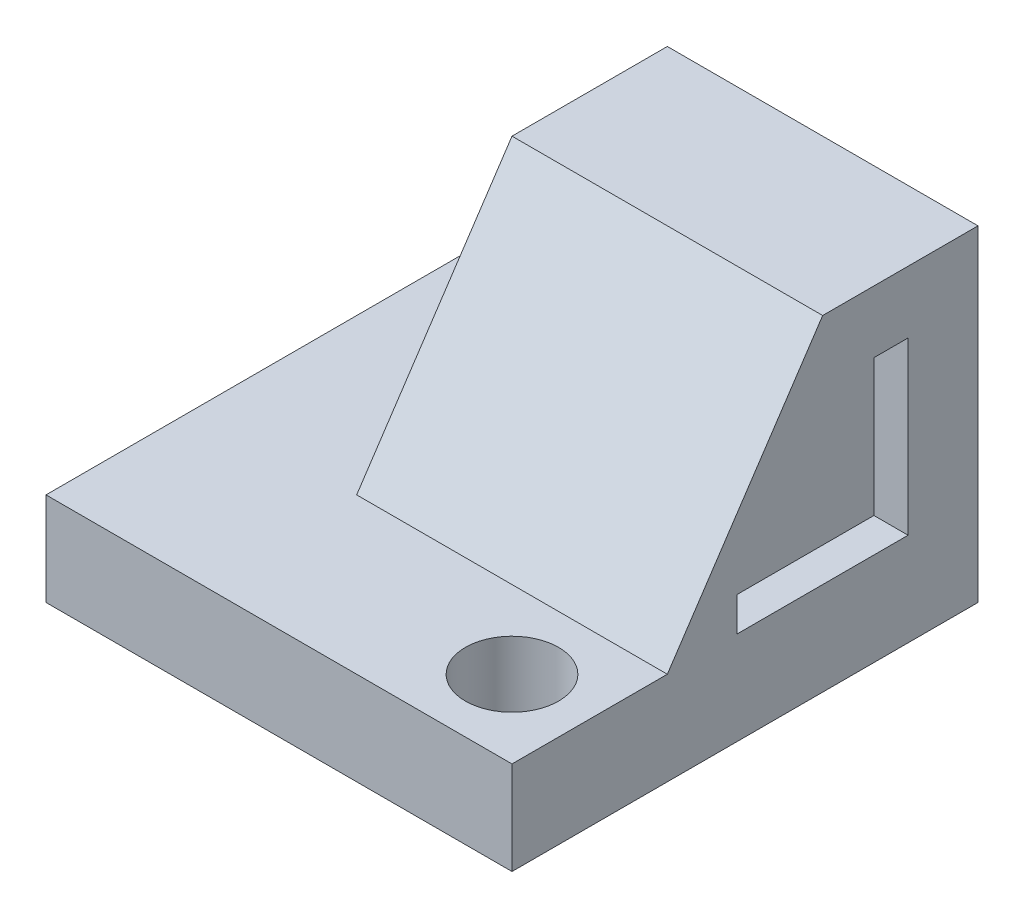
ISO-10303-21;
HEADER;
FILE_DESCRIPTION(('STEP AP214'),'2;1');
FILE_NAME('part.step','',(''),(''),'','','');
FILE_SCHEMA(('AUTOMOTIVE_DESIGN { 1 0 10303 214 1 1 1 1 }'));
ENDSEC;
DATA;
#1=APPLICATION_CONTEXT('core data for automotive mechanical design processes');
#2=APPLICATION_PROTOCOL_DEFINITION('international standard','automotive_design',2000,#1);
#3=PRODUCT_CONTEXT('',#1,'mechanical');
#4=PRODUCT('Part','Part','',(#3));
#5=PRODUCT_RELATED_PRODUCT_CATEGORY('part','',(#4));
#6=PRODUCT_DEFINITION_FORMATION('','',#4);
#7=PRODUCT_DEFINITION_CONTEXT('part definition',#1,'design');
#8=PRODUCT_DEFINITION('design','',#6,#7);
#9=PRODUCT_DEFINITION_SHAPE('','',#8);
#10=(LENGTH_UNIT() NAMED_UNIT(*) SI_UNIT(.MILLI.,.METRE.));
#11=(NAMED_UNIT(*) PLANE_ANGLE_UNIT() SI_UNIT($,.RADIAN.));
#12=(NAMED_UNIT(*) SI_UNIT($,.STERADIAN.) SOLID_ANGLE_UNIT());
#13=UNCERTAINTY_MEASURE_WITH_UNIT(LENGTH_MEASURE(1.E-05),#10,'distance_accuracy_value','');
#14=(GEOMETRIC_REPRESENTATION_CONTEXT(3) GLOBAL_UNCERTAINTY_ASSIGNED_CONTEXT((#13)) GLOBAL_UNIT_ASSIGNED_CONTEXT((#10,
#11,#12)) REPRESENTATION_CONTEXT('',''));
#15=CARTESIAN_POINT('',(0.,0.,0.));
#16=DIRECTION('',(0.,0.,1.));
#17=DIRECTION('',(1.,0.,0.));
#18=AXIS2_PLACEMENT_3D('',#15,#16,#17);
#19=CARTESIAN_POINT('',(-19.05,7.62,19.05));
#20=DIRECTION('',(1.,0.,0.));
#21=DIRECTION('',(0.,0.,-1.));
#22=AXIS2_PLACEMENT_3D('',#19,#20,#21);
#23=PLANE('',#22);
#24=DIRECTION('',(0.,0.,1.));
#25=VECTOR('',#24,1.);
#26=CARTESIAN_POINT('',(-19.05,0.,19.05));
#27=LINE('',#26,#25);
#28=CARTESIAN_POINT('',(-19.05,0.,-19.05));
#29=VERTEX_POINT('',#28);
#30=CARTESIAN_POINT('',(-19.05,0.,19.05));
#31=VERTEX_POINT('',#30);
#32=EDGE_CURVE('E162',#29,#31,#27,.T.);
#33=ORIENTED_EDGE('',*,*,#32,.T.);
#34=DIRECTION('',(0.,-1.,0.));
#35=VECTOR('',#34,1.);
#36=CARTESIAN_POINT('',(-19.05,7.62,19.05));
#37=LINE('',#36,#35);
#38=CARTESIAN_POINT('',(-19.05,7.62,19.05));
#39=VERTEX_POINT('',#38);
#40=EDGE_CURVE('E11',#39,#31,#37,.T.);
#41=ORIENTED_EDGE('',*,*,#40,.F.);
#42=DIRECTION('',(0.,0.,1.));
#43=VECTOR('',#42,1.);
#44=CARTESIAN_POINT('',(-19.05,7.62,19.05));
#45=LINE('',#44,#43);
#46=CARTESIAN_POINT('',(-19.05,7.62,-19.05));
#47=VERTEX_POINT('',#46);
#48=EDGE_CURVE('E158',#47,#39,#45,.T.);
#49=ORIENTED_EDGE('',*,*,#48,.F.);
#50=DIRECTION('',(0.,-1.,0.));
#51=VECTOR('',#50,1.);
#52=CARTESIAN_POINT('',(-19.05,7.62,-19.05));
#53=LINE('',#52,#51);
#54=EDGE_CURVE('E156',#47,#29,#53,.T.);
#55=ORIENTED_EDGE('',*,*,#54,.T.);
#56=EDGE_LOOP('',(#33,#41,#49,#55));
#57=FACE_BOUND('',#56,.T.);
#58=ADVANCED_FACE('F38',(#57),#23,.F.);
#59=CARTESIAN_POINT('',(19.05,7.62,19.05));
#60=DIRECTION('',(0.,0.,-1.));
#61=DIRECTION('',(-1.,0.,0.));
#62=AXIS2_PLACEMENT_3D('',#59,#60,#61);
#63=PLANE('',#62);
#64=DIRECTION('',(1.,0.,0.));
#65=VECTOR('',#64,1.);
#66=CARTESIAN_POINT('',(19.05,0.,19.05));
#67=LINE('',#66,#65);
#68=CARTESIAN_POINT('',(19.05,0.,19.05));
#69=VERTEX_POINT('',#68);
#70=EDGE_CURVE('E165',#31,#69,#67,.T.);
#71=ORIENTED_EDGE('',*,*,#70,.T.);
#72=DIRECTION('',(0.,-1.,0.));
#73=VECTOR('',#72,1.);
#74=CARTESIAN_POINT('',(19.05,7.62,19.05));
#75=LINE('',#74,#73);
#76=CARTESIAN_POINT('',(19.05,7.62,19.05));
#77=VERTEX_POINT('',#76);
#78=EDGE_CURVE('E45',#77,#69,#75,.T.);
#79=ORIENTED_EDGE('',*,*,#78,.F.);
#80=DIRECTION('',(1.,0.,0.));
#81=VECTOR('',#80,1.);
#82=CARTESIAN_POINT('',(19.05,7.62,19.05));
#83=LINE('',#82,#81);
#84=EDGE_CURVE('E152',#39,#77,#83,.T.);
#85=ORIENTED_EDGE('',*,*,#84,.F.);
#86=ORIENTED_EDGE('',*,*,#40,.T.);
#87=EDGE_LOOP('',(#71,#79,#85,#86));
#88=FACE_BOUND('',#87,.T.);
#89=ADVANCED_FACE('F276',(#88),#63,.F.);
#90=CARTESIAN_POINT('',(19.05,7.62,19.05));
#91=DIRECTION('',(-1.,0.,0.));
#92=DIRECTION('',(0.,0.,1.));
#93=AXIS2_PLACEMENT_3D('',#90,#91,#92);
#94=PLANE('',#93);
#95=DIRECTION('',(0.,0.,1.));
#96=VECTOR('',#95,1.);
#97=CARTESIAN_POINT('',(19.05,21.59,-10.541));
#98=LINE('',#97,#96);
#99=CARTESIAN_POINT('',(19.05,21.59,-13.335));
#100=VERTEX_POINT('',#99);
#101=CARTESIAN_POINT('',(19.05,21.59,-10.541));
#102=VERTEX_POINT('',#101);
#103=EDGE_CURVE('E237',#100,#102,#98,.T.);
#104=ORIENTED_EDGE('',*,*,#103,.F.);
#105=DIRECTION('',(0.,1.,0.));
#106=VECTOR('',#105,1.);
#107=CARTESIAN_POINT('',(19.05,21.59,-13.335));
#108=LINE('',#107,#106);
#109=CARTESIAN_POINT('',(19.05,7.62,-13.335));
#110=VERTEX_POINT('',#109);
#111=EDGE_CURVE('E60',#110,#100,#108,.T.);
#112=ORIENTED_EDGE('',*,*,#111,.F.);
#113=DIRECTION('',(0.,0.,-1.));
#114=VECTOR('',#113,1.);
#115=CARTESIAN_POINT('',(19.05,7.62,-13.335));
#116=LINE('',#115,#114);
#117=CARTESIAN_POINT('',(19.05,7.62,0.634999999999997));
#118=VERTEX_POINT('',#117);
#119=EDGE_CURVE('E224',#118,#110,#116,.T.);
#120=ORIENTED_EDGE('',*,*,#119,.F.);
#121=DIRECTION('',(0.,-1.,0.));
#122=VECTOR('',#121,1.);
#123=CARTESIAN_POINT('',(19.05,7.62,0.634999999999997));
#124=LINE('',#123,#122);
#125=CARTESIAN_POINT('',(19.05,10.414,0.634999999999997));
#126=VERTEX_POINT('',#125);
#127=EDGE_CURVE('E228',#126,#118,#124,.T.);
#128=ORIENTED_EDGE('',*,*,#127,.F.);
#129=DIRECTION('',(0.,0.,1.));
#130=VECTOR('',#129,1.);
#131=CARTESIAN_POINT('',(19.05,10.414,0.634999999999997));
#132=LINE('',#131,#130);
#133=CARTESIAN_POINT('',(19.05,10.414,-10.541));
#134=VERTEX_POINT('',#133);
#135=EDGE_CURVE('E231',#134,#126,#132,.T.);
#136=ORIENTED_EDGE('',*,*,#135,.F.);
#137=DIRECTION('',(0.,-1.,0.));
#138=VECTOR('',#137,1.);
#139=CARTESIAN_POINT('',(19.05,10.414,-10.541));
#140=LINE('',#139,#138);
#141=EDGE_CURVE('E234',#102,#134,#140,.T.);
#142=ORIENTED_EDGE('',*,*,#141,.F.);
#143=EDGE_LOOP('',(#104,#112,#120,#128,#136,#142));
#144=FACE_BOUND('',#143,.T.);
#145=DIRECTION('',(0.,0.,-1.));
#146=VECTOR('',#145,1.);
#147=CARTESIAN_POINT('',(19.05,26.67,6.34999999999999));
#148=LINE('',#147,#146);
#149=CARTESIAN_POINT('',(19.05,26.67,-6.35));
#150=VERTEX_POINT('',#149);
#151=CARTESIAN_POINT('',(19.05,26.67,-19.05));
#152=VERTEX_POINT('',#151);
#153=EDGE_CURVE('E147',#150,#152,#148,.T.);
#154=ORIENTED_EDGE('',*,*,#153,.F.);
#155=DIRECTION('',(0.,0.832050294337844,-0.554700196225229));
#156=VECTOR('',#155,1.);
#157=CARTESIAN_POINT('',(19.05,26.67,-6.35));
#158=LINE('',#157,#156);
#159=CARTESIAN_POINT('',(19.05,7.62,6.34999999999999));
#160=VERTEX_POINT('',#159);
#161=EDGE_CURVE('E52',#160,#150,#158,.T.);
#162=ORIENTED_EDGE('',*,*,#161,.F.);
#163=DIRECTION('',(0.,0.,-1.));
#164=VECTOR('',#163,1.);
#165=CARTESIAN_POINT('',(19.05,7.62,19.05));
#166=LINE('',#165,#164);
#167=EDGE_CURVE('E145',#77,#160,#166,.T.);
#168=ORIENTED_EDGE('',*,*,#167,.F.);
#169=ORIENTED_EDGE('',*,*,#78,.T.);
#170=DIRECTION('',(0.,0.,-1.));
#171=VECTOR('',#170,1.);
#172=CARTESIAN_POINT('',(19.05,0.,19.05));
#173=LINE('',#172,#171);
#174=CARTESIAN_POINT('',(19.05,0.,-19.05));
#175=VERTEX_POINT('',#174);
#176=EDGE_CURVE('E168',#69,#175,#173,.T.);
#177=ORIENTED_EDGE('',*,*,#176,.T.);
#178=DIRECTION('',(0.,-1.,0.));
#179=VECTOR('',#178,1.);
#180=CARTESIAN_POINT('',(19.05,7.62,-19.05));
#181=LINE('',#180,#179);
#182=EDGE_CURVE('E174',#152,#175,#181,.T.);
#183=ORIENTED_EDGE('',*,*,#182,.F.);
#184=EDGE_LOOP('',(#154,#162,#168,#169,#177,#183));
#185=FACE_BOUND('',#184,.T.);
#186=ADVANCED_FACE('F143',(#144,#185),#94,.F.);
#187=CARTESIAN_POINT('',(19.05,7.62,-19.05));
#188=DIRECTION('',(0.,0.,1.));
#189=DIRECTION('',(1.,0.,0.));
#190=AXIS2_PLACEMENT_3D('',#187,#188,#189);
#191=PLANE('',#190);
#192=DIRECTION('',(-1.,0.,0.));
#193=VECTOR('',#192,1.);
#194=CARTESIAN_POINT('',(19.05,0.,-19.05));
#195=LINE('',#194,#193);
#196=EDGE_CURVE('E170',#175,#29,#195,.T.);
#197=ORIENTED_EDGE('',*,*,#196,.T.);
#198=ORIENTED_EDGE('',*,*,#54,.F.);
#199=DIRECTION('',(-1.,0.,0.));
#200=VECTOR('',#199,1.);
#201=CARTESIAN_POINT('',(19.05,7.62,-19.05));
#202=LINE('',#201,#200);
#203=CARTESIAN_POINT('',(-6.34999999999999,7.62,-19.05));
#204=VERTEX_POINT('',#203);
#205=EDGE_CURVE('E154',#204,#47,#202,.T.);
#206=ORIENTED_EDGE('',*,*,#205,.F.);
#207=DIRECTION('',(0.,-1.,0.));
#208=VECTOR('',#207,1.);
#209=CARTESIAN_POINT('',(-6.34999999999999,26.67,-19.05));
#210=LINE('',#209,#208);
#211=CARTESIAN_POINT('',(-6.34999999999999,26.67,-19.05));
#212=VERTEX_POINT('',#211);
#213=EDGE_CURVE('E166',#212,#204,#210,.T.);
#214=ORIENTED_EDGE('',*,*,#213,.F.);
#215=DIRECTION('',(-1.,0.,0.));
#216=VECTOR('',#215,1.);
#217=CARTESIAN_POINT('',(19.05,26.67,-19.05));
#218=LINE('',#217,#216);
#219=EDGE_CURVE('E192',#152,#212,#218,.T.);
#220=ORIENTED_EDGE('',*,*,#219,.F.);
#221=ORIENTED_EDGE('',*,*,#182,.T.);
#222=EDGE_LOOP('',(#197,#198,#206,#214,#220,#221));
#223=FACE_BOUND('',#222,.T.);
#224=ADVANCED_FACE('F184',(#223),#191,.F.);
#225=CARTESIAN_POINT('',(0.,7.62,0.));
#226=DIRECTION('',(0.,1.,0.));
#227=DIRECTION('',(0.,0.,1.));
#228=AXIS2_PLACEMENT_3D('',#225,#226,#227);
#229=PLANE('',#228);
#230=CARTESIAN_POINT('',(-12.7,7.62,-12.7));
#231=DIRECTION('',(0.,1.,0.));
#232=DIRECTION('',(0.,0.,1.));
#233=AXIS2_PLACEMENT_3D('',#230,#231,#232);
#234=CIRCLE('',#233,3.81);
#235=CARTESIAN_POINT('',(-12.7,7.62,-8.89));
#236=VERTEX_POINT('',#235);
#237=EDGE_CURVE('E203',#236,#236,#234,.T.);
#238=ORIENTED_EDGE('',*,*,#237,.F.);
#239=EDGE_LOOP('',(#238));
#240=FACE_BOUND('',#239,.T.);
#241=CARTESIAN_POINT('',(12.7,7.62,12.7));
#242=DIRECTION('',(0.,1.,0.));
#243=DIRECTION('',(0.,0.,1.));
#244=AXIS2_PLACEMENT_3D('',#241,#242,#243);
#245=CIRCLE('',#244,3.81);
#246=CARTESIAN_POINT('',(12.7,7.62,16.51));
#247=VERTEX_POINT('',#246);
#248=EDGE_CURVE('E204',#247,#247,#245,.T.);
#249=ORIENTED_EDGE('',*,*,#248,.F.);
#250=EDGE_LOOP('',(#249));
#251=FACE_BOUND('',#250,.T.);
#252=DIRECTION('',(0.,0.,1.));
#253=VECTOR('',#252,1.);
#254=CARTESIAN_POINT('',(-6.34999999999999,7.62,6.35));
#255=LINE('',#254,#253);
#256=CARTESIAN_POINT('',(-6.34999999999999,7.62,6.34999999999999));
#257=VERTEX_POINT('',#256);
#258=EDGE_CURVE('E138',#204,#257,#255,.T.);
#259=ORIENTED_EDGE('',*,*,#258,.F.);
#260=ORIENTED_EDGE('',*,*,#205,.T.);
#261=ORIENTED_EDGE('',*,*,#48,.T.);
#262=ORIENTED_EDGE('',*,*,#84,.T.);
#263=ORIENTED_EDGE('',*,*,#167,.T.);
#264=DIRECTION('',(1.,0.,0.));
#265=VECTOR('',#264,1.);
#266=CARTESIAN_POINT('',(19.05,7.62,6.34999999999999));
#267=LINE('',#266,#265);
#268=EDGE_CURVE('E130',#257,#160,#267,.T.);
#269=ORIENTED_EDGE('',*,*,#268,.F.);
#270=EDGE_LOOP('',(#259,#260,#261,#262,#263,#269));
#271=FACE_BOUND('',#270,.T.);
#272=ADVANCED_FACE('F150',(#240,#251,#271),#229,.T.);
#273=CARTESIAN_POINT('',(0.,0.,0.));
#274=DIRECTION('',(0.,1.,0.));
#275=DIRECTION('',(0.,0.,1.));
#276=AXIS2_PLACEMENT_3D('',#273,#274,#275);
#277=PLANE('',#276);
#278=CARTESIAN_POINT('',(-12.7,0.,-12.7));
#279=DIRECTION('',(0.,1.,0.));
#280=DIRECTION('',(0.,0.,1.));
#281=AXIS2_PLACEMENT_3D('',#278,#279,#280);
#282=CIRCLE('',#281,3.81);
#283=CARTESIAN_POINT('',(-12.7,0.,-8.89));
#284=VERTEX_POINT('',#283);
#285=EDGE_CURVE('E195',#284,#284,#282,.F.);
#286=ORIENTED_EDGE('',*,*,#285,.F.);
#287=EDGE_LOOP('',(#286));
#288=FACE_BOUND('',#287,.T.);
#289=CARTESIAN_POINT('',(12.7,0.,12.7));
#290=DIRECTION('',(0.,1.,0.));
#291=DIRECTION('',(0.,0.,1.));
#292=AXIS2_PLACEMENT_3D('',#289,#290,#291);
#293=CIRCLE('',#292,3.81);
#294=CARTESIAN_POINT('',(12.7,0.,16.51));
#295=VERTEX_POINT('',#294);
#296=EDGE_CURVE('E200',#295,#295,#293,.F.);
#297=ORIENTED_EDGE('',*,*,#296,.F.);
#298=EDGE_LOOP('',(#297));
#299=FACE_BOUND('',#298,.T.);
#300=ORIENTED_EDGE('',*,*,#32,.F.);
#301=ORIENTED_EDGE('',*,*,#196,.F.);
#302=ORIENTED_EDGE('',*,*,#176,.F.);
#303=ORIENTED_EDGE('',*,*,#70,.F.);
#304=EDGE_LOOP('',(#300,#301,#302,#303));
#305=FACE_BOUND('',#304,.T.);
#306=ADVANCED_FACE('F181',(#288,#299,#305),#277,.F.);
#307=CARTESIAN_POINT('',(-6.34999999999999,26.67,6.35));
#308=DIRECTION('',(1.,0.,0.));
#309=DIRECTION('',(0.,0.,-1.));
#310=AXIS2_PLACEMENT_3D('',#307,#308,#309);
#311=PLANE('',#310);
#312=ORIENTED_EDGE('',*,*,#258,.T.);
#313=DIRECTION('',(0.,-0.832050294337844,0.554700196225229));
#314=VECTOR('',#313,1.);
#315=CARTESIAN_POINT('',(-6.34999999999999,26.67,-6.35));
#316=LINE('',#315,#314);
#317=CARTESIAN_POINT('',(-6.34999999999999,26.67,-6.35));
#318=VERTEX_POINT('',#317);
#319=EDGE_CURVE('E133',#318,#257,#316,.T.);
#320=ORIENTED_EDGE('',*,*,#319,.F.);
#321=DIRECTION('',(0.,0.,1.));
#322=VECTOR('',#321,1.);
#323=CARTESIAN_POINT('',(-6.34999999999999,26.67,6.35));
#324=LINE('',#323,#322);
#325=EDGE_CURVE('E137',#212,#318,#324,.T.);
#326=ORIENTED_EDGE('',*,*,#325,.F.);
#327=ORIENTED_EDGE('',*,*,#213,.T.);
#328=EDGE_LOOP('',(#312,#320,#326,#327));
#329=FACE_BOUND('',#328,.T.);
#330=ADVANCED_FACE('F262',(#329),#311,.F.);
#331=CARTESIAN_POINT('',(0.,26.67,0.));
#332=DIRECTION('',(0.,1.,0.));
#333=DIRECTION('',(0.,0.,1.));
#334=AXIS2_PLACEMENT_3D('',#331,#332,#333);
#335=PLANE('',#334);
#336=DIRECTION('',(1.,0.,0.));
#337=VECTOR('',#336,1.);
#338=CARTESIAN_POINT('',(-19.051,26.67,-6.35));
#339=LINE('',#338,#337);
#340=EDGE_CURVE('E148',#318,#150,#339,.T.);
#341=ORIENTED_EDGE('',*,*,#340,.T.);
#342=ORIENTED_EDGE('',*,*,#153,.T.);
#343=ORIENTED_EDGE('',*,*,#219,.T.);
#344=ORIENTED_EDGE('',*,*,#325,.T.);
#345=EDGE_LOOP('',(#341,#342,#343,#344));
#346=FACE_BOUND('',#345,.T.);
#347=ADVANCED_FACE('F259',(#346),#335,.T.);
#348=CARTESIAN_POINT('',(12.7,-0.00100000000000013,12.7));
#349=DIRECTION('',(0.,1.,0.));
#350=DIRECTION('',(0.,0.,1.));
#351=AXIS2_PLACEMENT_3D('',#348,#349,#350);
#352=CYLINDRICAL_SURFACE('',#351,3.81);
#353=ORIENTED_EDGE('',*,*,#248,.T.);
#354=EDGE_LOOP('',(#353));
#355=FACE_BOUND('',#354,.T.);
#356=ORIENTED_EDGE('',*,*,#296,.T.);
#357=EDGE_LOOP('',(#356));
#358=FACE_BOUND('',#357,.T.);
#359=ADVANCED_FACE('F270',(#355,#358),#352,.F.);
#360=CARTESIAN_POINT('',(-12.7,-0.00100000000000013,-12.7));
#361=DIRECTION('',(0.,1.,0.));
#362=DIRECTION('',(0.,0.,1.));
#363=AXIS2_PLACEMENT_3D('',#360,#361,#362);
#364=CYLINDRICAL_SURFACE('',#363,3.81);
#365=ORIENTED_EDGE('',*,*,#237,.T.);
#366=EDGE_LOOP('',(#365));
#367=FACE_BOUND('',#366,.T.);
#368=ORIENTED_EDGE('',*,*,#285,.T.);
#369=EDGE_LOOP('',(#368));
#370=FACE_BOUND('',#369,.T.);
#371=ADVANCED_FACE('F297',(#367,#370),#364,.F.);
#372=CARTESIAN_POINT('',(12.7,21.59,-13.335));
#373=DIRECTION('',(0.,0.,-1.));
#374=DIRECTION('',(-1.,0.,0.));
#375=AXIS2_PLACEMENT_3D('',#372,#373,#374);
#376=PLANE('',#375);
#377=ORIENTED_EDGE('',*,*,#111,.T.);
#378=DIRECTION('',(1.,0.,0.));
#379=VECTOR('',#378,1.);
#380=CARTESIAN_POINT('',(12.7,21.59,-13.335));
#381=LINE('',#380,#379);
#382=CARTESIAN_POINT('',(12.7,21.59,-13.335));
#383=VERTEX_POINT('',#382);
#384=EDGE_CURVE('E212',#383,#100,#381,.T.);
#385=ORIENTED_EDGE('',*,*,#384,.F.);
#386=DIRECTION('',(0.,1.,0.));
#387=VECTOR('',#386,1.);
#388=CARTESIAN_POINT('',(12.7,21.59,-13.335));
#389=LINE('',#388,#387);
#390=CARTESIAN_POINT('',(12.7,7.62,-13.335));
#391=VERTEX_POINT('',#390);
#392=EDGE_CURVE('E227',#391,#383,#389,.T.);
#393=ORIENTED_EDGE('',*,*,#392,.F.);
#394=DIRECTION('',(1.,0.,0.));
#395=VECTOR('',#394,1.);
#396=CARTESIAN_POINT('',(12.7,7.62,-13.335));
#397=LINE('',#396,#395);
#398=EDGE_CURVE('E207',#391,#110,#397,.T.);
#399=ORIENTED_EDGE('',*,*,#398,.T.);
#400=EDGE_LOOP('',(#377,#385,#393,#399));
#401=FACE_BOUND('',#400,.T.);
#402=ADVANCED_FACE('F304',(#401),#376,.F.);
#403=CARTESIAN_POINT('',(12.7,7.62,-13.335));
#404=DIRECTION('',(0.,-1.,0.));
#405=DIRECTION('',(0.,0.,-1.));
#406=AXIS2_PLACEMENT_3D('',#403,#404,#405);
#407=PLANE('',#406);
#408=ORIENTED_EDGE('',*,*,#119,.T.);
#409=ORIENTED_EDGE('',*,*,#398,.F.);
#410=DIRECTION('',(0.,0.,-1.));
#411=VECTOR('',#410,1.);
#412=CARTESIAN_POINT('',(12.7,7.62,-13.335));
#413=LINE('',#412,#411);
#414=CARTESIAN_POINT('',(12.7,7.62,0.634999999999997));
#415=VERTEX_POINT('',#414);
#416=EDGE_CURVE('E215',#415,#391,#413,.T.);
#417=ORIENTED_EDGE('',*,*,#416,.F.);
#418=DIRECTION('',(1.,0.,0.));
#419=VECTOR('',#418,1.);
#420=CARTESIAN_POINT('',(12.7,7.62,0.634999999999997));
#421=LINE('',#420,#419);
#422=EDGE_CURVE('E221',#415,#118,#421,.T.);
#423=ORIENTED_EDGE('',*,*,#422,.T.);
#424=EDGE_LOOP('',(#408,#409,#417,#423));
#425=FACE_BOUND('',#424,.T.);
#426=ADVANCED_FACE('F310',(#425),#407,.F.);
#427=CARTESIAN_POINT('',(12.7,7.62,0.634999999999997));
#428=DIRECTION('',(0.,0.,1.));
#429=DIRECTION('',(1.,0.,0.));
#430=AXIS2_PLACEMENT_3D('',#427,#428,#429);
#431=PLANE('',#430);
#432=ORIENTED_EDGE('',*,*,#127,.T.);
#433=ORIENTED_EDGE('',*,*,#422,.F.);
#434=DIRECTION('',(0.,-1.,0.));
#435=VECTOR('',#434,1.);
#436=CARTESIAN_POINT('',(12.7,7.62,0.634999999999997));
#437=LINE('',#436,#435);
#438=CARTESIAN_POINT('',(12.7,10.414,0.634999999999997));
#439=VERTEX_POINT('',#438);
#440=EDGE_CURVE('E243',#439,#415,#437,.T.);
#441=ORIENTED_EDGE('',*,*,#440,.F.);
#442=DIRECTION('',(1.,0.,0.));
#443=VECTOR('',#442,1.);
#444=CARTESIAN_POINT('',(12.7,10.414,0.634999999999997));
#445=LINE('',#444,#443);
#446=EDGE_CURVE('E219',#439,#126,#445,.T.);
#447=ORIENTED_EDGE('',*,*,#446,.T.);
#448=EDGE_LOOP('',(#432,#433,#441,#447));
#449=FACE_BOUND('',#448,.T.);
#450=ADVANCED_FACE('F323',(#449),#431,.F.);
#451=CARTESIAN_POINT('',(12.7,10.414,0.634999999999997));
#452=DIRECTION('',(0.,1.,0.));
#453=DIRECTION('',(0.,0.,1.));
#454=AXIS2_PLACEMENT_3D('',#451,#452,#453);
#455=PLANE('',#454);
#456=ORIENTED_EDGE('',*,*,#135,.T.);
#457=ORIENTED_EDGE('',*,*,#446,.F.);
#458=DIRECTION('',(0.,0.,1.));
#459=VECTOR('',#458,1.);
#460=CARTESIAN_POINT('',(12.7,10.414,0.634999999999997));
#461=LINE('',#460,#459);
#462=CARTESIAN_POINT('',(12.7,10.414,-10.541));
#463=VERTEX_POINT('',#462);
#464=EDGE_CURVE('E246',#463,#439,#461,.T.);
#465=ORIENTED_EDGE('',*,*,#464,.F.);
#466=DIRECTION('',(1.,0.,0.));
#467=VECTOR('',#466,1.);
#468=CARTESIAN_POINT('',(12.7,10.414,-10.541));
#469=LINE('',#468,#467);
#470=EDGE_CURVE('E217',#463,#134,#469,.T.);
#471=ORIENTED_EDGE('',*,*,#470,.T.);
#472=EDGE_LOOP('',(#456,#457,#465,#471));
#473=FACE_BOUND('',#472,.T.);
#474=ADVANCED_FACE('F319',(#473),#455,.F.);
#475=CARTESIAN_POINT('',(12.7,10.414,-10.541));
#476=DIRECTION('',(0.,0.,1.));
#477=DIRECTION('',(0.,-1.,0.));
#478=AXIS2_PLACEMENT_3D('',#475,#476,#477);
#479=PLANE('',#478);
#480=ORIENTED_EDGE('',*,*,#141,.T.);
#481=ORIENTED_EDGE('',*,*,#470,.F.);
#482=DIRECTION('',(0.,-1.,0.));
#483=VECTOR('',#482,1.);
#484=CARTESIAN_POINT('',(12.7,10.414,-10.541));
#485=LINE('',#484,#483);
#486=CARTESIAN_POINT('',(12.7,21.59,-10.541));
#487=VERTEX_POINT('',#486);
#488=EDGE_CURVE('E249',#487,#463,#485,.T.);
#489=ORIENTED_EDGE('',*,*,#488,.F.);
#490=DIRECTION('',(1.,0.,0.));
#491=VECTOR('',#490,1.);
#492=CARTESIAN_POINT('',(12.7,21.59,-10.541));
#493=LINE('',#492,#491);
#494=EDGE_CURVE('E214',#487,#102,#493,.T.);
#495=ORIENTED_EDGE('',*,*,#494,.T.);
#496=EDGE_LOOP('',(#480,#481,#489,#495));
#497=FACE_BOUND('',#496,.T.);
#498=ADVANCED_FACE('F315',(#497),#479,.F.);
#499=CARTESIAN_POINT('',(12.7,21.59,-10.541));
#500=DIRECTION('',(0.,1.,0.));
#501=DIRECTION('',(0.,0.,1.));
#502=AXIS2_PLACEMENT_3D('',#499,#500,#501);
#503=PLANE('',#502);
#504=ORIENTED_EDGE('',*,*,#103,.T.);
#505=ORIENTED_EDGE('',*,*,#494,.F.);
#506=DIRECTION('',(0.,0.,1.));
#507=VECTOR('',#506,1.);
#508=CARTESIAN_POINT('',(12.7,21.59,-10.541));
#509=LINE('',#508,#507);
#510=EDGE_CURVE('E252',#383,#487,#509,.T.);
#511=ORIENTED_EDGE('',*,*,#510,.F.);
#512=ORIENTED_EDGE('',*,*,#384,.T.);
#513=EDGE_LOOP('',(#504,#505,#511,#512));
#514=FACE_BOUND('',#513,.T.);
#515=ADVANCED_FACE('F311',(#514),#503,.F.);
#516=CARTESIAN_POINT('',(12.7,0.,0.));
#517=DIRECTION('',(-1.,0.,0.));
#518=DIRECTION('',(0.,0.,1.));
#519=AXIS2_PLACEMENT_3D('',#516,#517,#518);
#520=PLANE('',#519);
#521=ORIENTED_EDGE('',*,*,#392,.T.);
#522=ORIENTED_EDGE('',*,*,#510,.T.);
#523=ORIENTED_EDGE('',*,*,#488,.T.);
#524=ORIENTED_EDGE('',*,*,#464,.T.);
#525=ORIENTED_EDGE('',*,*,#440,.T.);
#526=ORIENTED_EDGE('',*,*,#416,.T.);
#527=EDGE_LOOP('',(#521,#522,#523,#524,#525,#526));
#528=FACE_BOUND('',#527,.T.);
#529=ADVANCED_FACE('F314',(#528),#520,.F.);
#530=CARTESIAN_POINT('',(-19.051,26.67,-6.35));
#531=DIRECTION('',(0.,-0.554700196225229,-0.832050294337844));
#532=DIRECTION('',(0.,0.832050294337844,-0.554700196225229));
#533=AXIS2_PLACEMENT_3D('',#530,#531,#532);
#534=PLANE('',#533);
#535=ORIENTED_EDGE('',*,*,#319,.T.);
#536=ORIENTED_EDGE('',*,*,#268,.T.);
#537=ORIENTED_EDGE('',*,*,#161,.T.);
#538=ORIENTED_EDGE('',*,*,#340,.F.);
#539=EDGE_LOOP('',(#535,#536,#537,#538));
#540=FACE_BOUND('',#539,.T.);
#541=ADVANCED_FACE('F131',(#540),#534,.F.);
#542=CLOSED_SHELL('',(#58,#89,#186,#224,#272,#306,#330,#347,#359,#371,#402,#426,#450,#474,#498,
#515,#529,#541));
#543=MANIFOLD_SOLID_BREP('B2',#542);
#544=ADVANCED_BREP_SHAPE_REPRESENTATION('',(#18,#543),#14);
#545=SHAPE_DEFINITION_REPRESENTATION(#9,#544);
ENDSEC;
END-ISO-10303-21;
